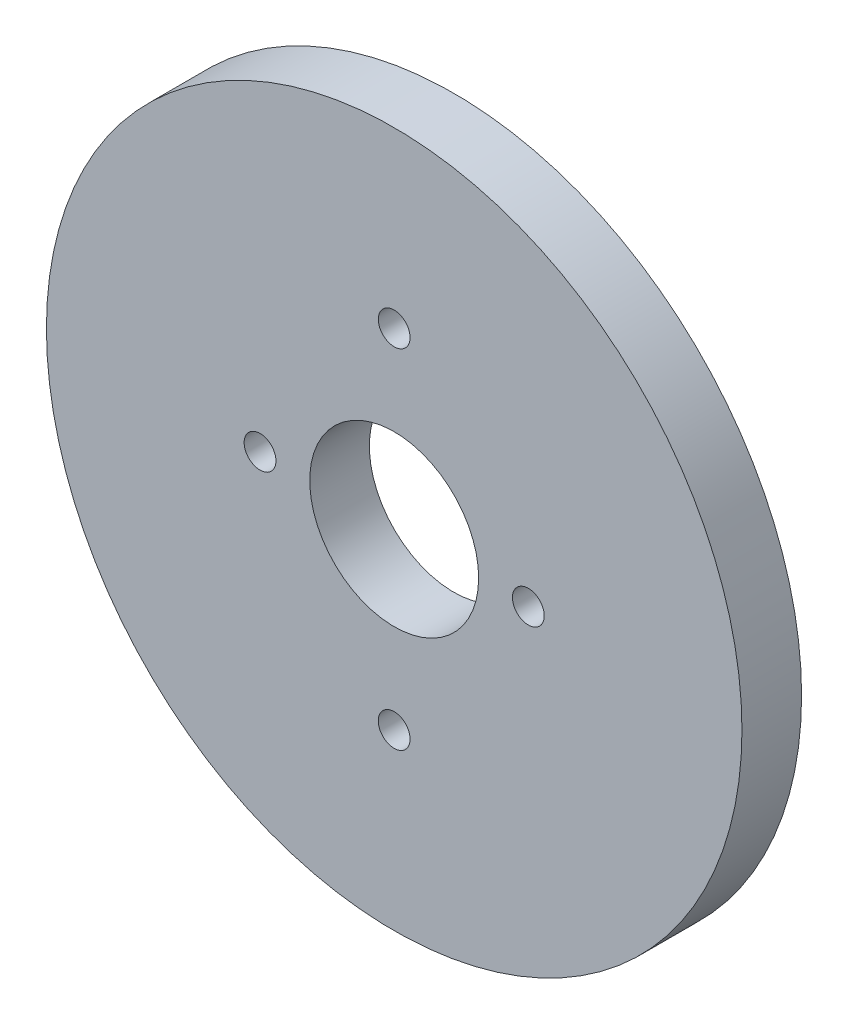
ISO-10303-21;
HEADER;
FILE_DESCRIPTION(('STEP AP214'),'2;1');
FILE_NAME('part.step','',(''),(''),'','','');
FILE_SCHEMA(('AUTOMOTIVE_DESIGN { 1 0 10303 214 1 1 1 1 }'));
ENDSEC;
DATA;
#1=APPLICATION_CONTEXT('core data for automotive mechanical design processes');
#2=APPLICATION_PROTOCOL_DEFINITION('international standard','automotive_design',2000,#1);
#3=PRODUCT_CONTEXT('',#1,'mechanical');
#4=PRODUCT('Part','Part','',(#3));
#5=PRODUCT_RELATED_PRODUCT_CATEGORY('part','',(#4));
#6=PRODUCT_DEFINITION_FORMATION('','',#4);
#7=PRODUCT_DEFINITION_CONTEXT('part definition',#1,'design');
#8=PRODUCT_DEFINITION('design','',#6,#7);
#9=PRODUCT_DEFINITION_SHAPE('','',#8);
#10=(LENGTH_UNIT() NAMED_UNIT(*) SI_UNIT(.MILLI.,.METRE.));
#11=(NAMED_UNIT(*) PLANE_ANGLE_UNIT() SI_UNIT($,.RADIAN.));
#12=(NAMED_UNIT(*) SI_UNIT($,.STERADIAN.) SOLID_ANGLE_UNIT());
#13=UNCERTAINTY_MEASURE_WITH_UNIT(LENGTH_MEASURE(1.E-05),#10,'distance_accuracy_value','');
#14=(GEOMETRIC_REPRESENTATION_CONTEXT(3) GLOBAL_UNCERTAINTY_ASSIGNED_CONTEXT((#13)) GLOBAL_UNIT_ASSIGNED_CONTEXT((#10,
#11,#12)) REPRESENTATION_CONTEXT('',''));
#15=CARTESIAN_POINT('',(0.,0.,0.));
#16=DIRECTION('',(0.,0.,1.));
#17=DIRECTION('',(1.,0.,0.));
#18=AXIS2_PLACEMENT_3D('',#15,#16,#17);
#19=CARTESIAN_POINT('',(0.,0.,3.));
#20=DIRECTION('',(0.,0.,1.));
#21=DIRECTION('',(1.,0.,0.));
#22=AXIS2_PLACEMENT_3D('',#19,#20,#21);
#23=PLANE('',#22);
#24=CARTESIAN_POINT('',(0.,-8.75,3.));
#25=DIRECTION('',(0.,0.,1.));
#26=DIRECTION('',(-1.,0.,0.));
#27=AXIS2_PLACEMENT_3D('',#24,#25,#26);
#28=CIRCLE('',#27,0.8);
#29=CARTESIAN_POINT('',(-0.8,-8.75,3.));
#30=VERTEX_POINT('',#29);
#31=EDGE_CURVE('E59',#30,#30,#28,.T.);
#32=ORIENTED_EDGE('',*,*,#31,.F.);
#33=EDGE_LOOP('',(#32));
#34=FACE_BOUND('',#33,.T.);
#35=CARTESIAN_POINT('',(6.75,0.,3.));
#36=DIRECTION('',(0.,0.,1.));
#37=DIRECTION('',(1.,0.,0.));
#38=AXIS2_PLACEMENT_3D('',#35,#36,#37);
#39=CIRCLE('',#38,0.8);
#40=CARTESIAN_POINT('',(7.55,0.,3.));
#41=VERTEX_POINT('',#40);
#42=EDGE_CURVE('E47',#41,#41,#39,.T.);
#43=ORIENTED_EDGE('',*,*,#42,.F.);
#44=EDGE_LOOP('',(#43));
#45=FACE_BOUND('',#44,.T.);
#46=CARTESIAN_POINT('',(0.,0.,3.));
#47=DIRECTION('',(0.,0.,1.));
#48=DIRECTION('',(1.,0.,0.));
#49=AXIS2_PLACEMENT_3D('',#46,#47,#48);
#50=CIRCLE('',#49,17.5);
#51=CARTESIAN_POINT('',(17.5,0.,3.));
#52=VERTEX_POINT('',#51);
#53=EDGE_CURVE('E10',#52,#52,#50,.T.);
#54=ORIENTED_EDGE('',*,*,#53,.T.);
#55=EDGE_LOOP('',(#54));
#56=FACE_BOUND('',#55,.T.);
#57=CARTESIAN_POINT('',(0.,0.,3.));
#58=DIRECTION('',(0.,0.,1.));
#59=DIRECTION('',(1.,0.,0.));
#60=AXIS2_PLACEMENT_3D('',#57,#58,#59);
#61=CIRCLE('',#60,4.25);
#62=CARTESIAN_POINT('',(4.25,0.,3.));
#63=VERTEX_POINT('',#62);
#64=EDGE_CURVE('E42',#63,#63,#61,.T.);
#65=ORIENTED_EDGE('',*,*,#64,.F.);
#66=EDGE_LOOP('',(#65));
#67=FACE_BOUND('',#66,.T.);
#68=CARTESIAN_POINT('',(0.,8.75,3.));
#69=DIRECTION('',(0.,0.,1.));
#70=DIRECTION('',(1.,0.,0.));
#71=AXIS2_PLACEMENT_3D('',#68,#69,#70);
#72=CIRCLE('',#71,0.8);
#73=CARTESIAN_POINT('',(0.8,8.75,3.));
#74=VERTEX_POINT('',#73);
#75=EDGE_CURVE('E53',#74,#74,#72,.T.);
#76=ORIENTED_EDGE('',*,*,#75,.F.);
#77=EDGE_LOOP('',(#76));
#78=FACE_BOUND('',#77,.T.);
#79=CARTESIAN_POINT('',(-6.75,0.,3.));
#80=DIRECTION('',(0.,0.,1.));
#81=DIRECTION('',(-1.,0.,0.));
#82=AXIS2_PLACEMENT_3D('',#79,#80,#81);
#83=CIRCLE('',#82,0.8);
#84=CARTESIAN_POINT('',(-7.55,0.,3.));
#85=VERTEX_POINT('',#84);
#86=EDGE_CURVE('E65',#85,#85,#83,.T.);
#87=ORIENTED_EDGE('',*,*,#86,.F.);
#88=EDGE_LOOP('',(#87));
#89=FACE_BOUND('',#88,.T.);
#90=ADVANCED_FACE('F31',(#34,#45,#56,#67,#78,#89),#23,.T.);
#91=CARTESIAN_POINT('',(0.,0.,0.));
#92=DIRECTION('',(0.,0.,1.));
#93=DIRECTION('',(1.,0.,0.));
#94=AXIS2_PLACEMENT_3D('',#91,#92,#93);
#95=PLANE('',#94);
#96=CARTESIAN_POINT('',(0.,0.,0.));
#97=DIRECTION('',(0.,0.,1.));
#98=DIRECTION('',(1.,0.,0.));
#99=AXIS2_PLACEMENT_3D('',#96,#97,#98);
#100=CIRCLE('',#99,17.5);
#101=CARTESIAN_POINT('',(17.5,0.,0.));
#102=VERTEX_POINT('',#101);
#103=EDGE_CURVE('E35',#102,#102,#100,.T.);
#104=ORIENTED_EDGE('',*,*,#103,.F.);
#105=EDGE_LOOP('',(#104));
#106=FACE_BOUND('',#105,.T.);
#107=CARTESIAN_POINT('',(0.,0.,0.));
#108=DIRECTION('',(0.,0.,1.));
#109=DIRECTION('',(1.,0.,0.));
#110=AXIS2_PLACEMENT_3D('',#107,#108,#109);
#111=CIRCLE('',#110,4.25);
#112=CARTESIAN_POINT('',(4.25,0.,0.));
#113=VERTEX_POINT('',#112);
#114=EDGE_CURVE('E44',#113,#113,#111,.T.);
#115=ORIENTED_EDGE('',*,*,#114,.T.);
#116=EDGE_LOOP('',(#115));
#117=FACE_BOUND('',#116,.T.);
#118=CARTESIAN_POINT('',(6.75,0.,0.));
#119=DIRECTION('',(0.,0.,1.));
#120=DIRECTION('',(1.,0.,0.));
#121=AXIS2_PLACEMENT_3D('',#118,#119,#120);
#122=CIRCLE('',#121,0.8);
#123=CARTESIAN_POINT('',(7.55,0.,0.));
#124=VERTEX_POINT('',#123);
#125=EDGE_CURVE('E50',#124,#124,#122,.T.);
#126=ORIENTED_EDGE('',*,*,#125,.T.);
#127=EDGE_LOOP('',(#126));
#128=FACE_BOUND('',#127,.T.);
#129=CARTESIAN_POINT('',(0.,8.75,0.));
#130=DIRECTION('',(0.,0.,1.));
#131=DIRECTION('',(1.,0.,0.));
#132=AXIS2_PLACEMENT_3D('',#129,#130,#131);
#133=CIRCLE('',#132,0.8);
#134=CARTESIAN_POINT('',(0.8,8.75,0.));
#135=VERTEX_POINT('',#134);
#136=EDGE_CURVE('E56',#135,#135,#133,.T.);
#137=ORIENTED_EDGE('',*,*,#136,.T.);
#138=EDGE_LOOP('',(#137));
#139=FACE_BOUND('',#138,.T.);
#140=CARTESIAN_POINT('',(0.,-8.75,0.));
#141=DIRECTION('',(0.,0.,1.));
#142=DIRECTION('',(-1.,0.,0.));
#143=AXIS2_PLACEMENT_3D('',#140,#141,#142);
#144=CIRCLE('',#143,0.8);
#145=CARTESIAN_POINT('',(-0.8,-8.75,0.));
#146=VERTEX_POINT('',#145);
#147=EDGE_CURVE('E62',#146,#146,#144,.T.);
#148=ORIENTED_EDGE('',*,*,#147,.T.);
#149=EDGE_LOOP('',(#148));
#150=FACE_BOUND('',#149,.T.);
#151=CARTESIAN_POINT('',(-6.75,0.,0.));
#152=DIRECTION('',(0.,0.,1.));
#153=DIRECTION('',(-1.,0.,0.));
#154=AXIS2_PLACEMENT_3D('',#151,#152,#153);
#155=CIRCLE('',#154,0.8);
#156=CARTESIAN_POINT('',(-7.55,0.,0.));
#157=VERTEX_POINT('',#156);
#158=EDGE_CURVE('E68',#157,#157,#155,.T.);
#159=ORIENTED_EDGE('',*,*,#158,.T.);
#160=EDGE_LOOP('',(#159));
#161=FACE_BOUND('',#160,.T.);
#162=ADVANCED_FACE('F78',(#106,#117,#128,#139,#150,#161),#95,.F.);
#163=CARTESIAN_POINT('',(0.,0.,3.));
#164=DIRECTION('',(0.,0.,-1.));
#165=DIRECTION('',(-1.,0.,0.));
#166=AXIS2_PLACEMENT_3D('',#163,#164,#165);
#167=CYLINDRICAL_SURFACE('',#166,17.5);
#168=ORIENTED_EDGE('',*,*,#53,.F.);
#169=EDGE_LOOP('',(#168));
#170=FACE_BOUND('',#169,.T.);
#171=ORIENTED_EDGE('',*,*,#103,.T.);
#172=EDGE_LOOP('',(#171));
#173=FACE_BOUND('',#172,.T.);
#174=ADVANCED_FACE('F33',(#170,#173),#167,.T.);
#175=CARTESIAN_POINT('',(0.,0.,3.));
#176=DIRECTION('',(0.,0.,-1.));
#177=DIRECTION('',(-1.,0.,0.));
#178=AXIS2_PLACEMENT_3D('',#175,#176,#177);
#179=CYLINDRICAL_SURFACE('',#178,4.25);
#180=ORIENTED_EDGE('',*,*,#64,.T.);
#181=EDGE_LOOP('',(#180));
#182=FACE_BOUND('',#181,.T.);
#183=ORIENTED_EDGE('',*,*,#114,.F.);
#184=EDGE_LOOP('',(#183));
#185=FACE_BOUND('',#184,.T.);
#186=ADVANCED_FACE('F88',(#182,#185),#179,.F.);
#187=CARTESIAN_POINT('',(6.75,0.,3.));
#188=DIRECTION('',(0.,0.,-1.));
#189=DIRECTION('',(-1.,0.,0.));
#190=AXIS2_PLACEMENT_3D('',#187,#188,#189);
#191=CYLINDRICAL_SURFACE('',#190,0.8);
#192=ORIENTED_EDGE('',*,*,#42,.T.);
#193=EDGE_LOOP('',(#192));
#194=FACE_BOUND('',#193,.T.);
#195=ORIENTED_EDGE('',*,*,#125,.F.);
#196=EDGE_LOOP('',(#195));
#197=FACE_BOUND('',#196,.T.);
#198=ADVANCED_FACE('F91',(#194,#197),#191,.F.);
#199=CARTESIAN_POINT('',(0.,8.75,3.));
#200=DIRECTION('',(0.,0.,-1.));
#201=DIRECTION('',(-1.,0.,0.));
#202=AXIS2_PLACEMENT_3D('',#199,#200,#201);
#203=CYLINDRICAL_SURFACE('',#202,0.8);
#204=ORIENTED_EDGE('',*,*,#75,.T.);
#205=EDGE_LOOP('',(#204));
#206=FACE_BOUND('',#205,.T.);
#207=ORIENTED_EDGE('',*,*,#136,.F.);
#208=EDGE_LOOP('',(#207));
#209=FACE_BOUND('',#208,.T.);
#210=ADVANCED_FACE('F95',(#206,#209),#203,.F.);
#211=CARTESIAN_POINT('',(0.,-8.75,3.));
#212=DIRECTION('',(0.,0.,-1.));
#213=DIRECTION('',(-1.,0.,0.));
#214=AXIS2_PLACEMENT_3D('',#211,#212,#213);
#215=CYLINDRICAL_SURFACE('',#214,0.8);
#216=ORIENTED_EDGE('',*,*,#31,.T.);
#217=EDGE_LOOP('',(#216));
#218=FACE_BOUND('',#217,.T.);
#219=ORIENTED_EDGE('',*,*,#147,.F.);
#220=EDGE_LOOP('',(#219));
#221=FACE_BOUND('',#220,.T.);
#222=ADVANCED_FACE('F99',(#218,#221),#215,.F.);
#223=CARTESIAN_POINT('',(-6.75,0.,3.));
#224=DIRECTION('',(0.,0.,-1.));
#225=DIRECTION('',(-1.,0.,0.));
#226=AXIS2_PLACEMENT_3D('',#223,#224,#225);
#227=CYLINDRICAL_SURFACE('',#226,0.8);
#228=ORIENTED_EDGE('',*,*,#86,.T.);
#229=EDGE_LOOP('',(#228));
#230=FACE_BOUND('',#229,.T.);
#231=ORIENTED_EDGE('',*,*,#158,.F.);
#232=EDGE_LOOP('',(#231));
#233=FACE_BOUND('',#232,.T.);
#234=ADVANCED_FACE('F74',(#230,#233),#227,.F.);
#235=CLOSED_SHELL('',(#90,#162,#174,#186,#198,#210,#222,#234));
#236=MANIFOLD_SOLID_BREP('B2',#235);
#237=ADVANCED_BREP_SHAPE_REPRESENTATION('',(#18,#236),#14);
#238=SHAPE_DEFINITION_REPRESENTATION(#9,#237);
ENDSEC;
END-ISO-10303-21;
